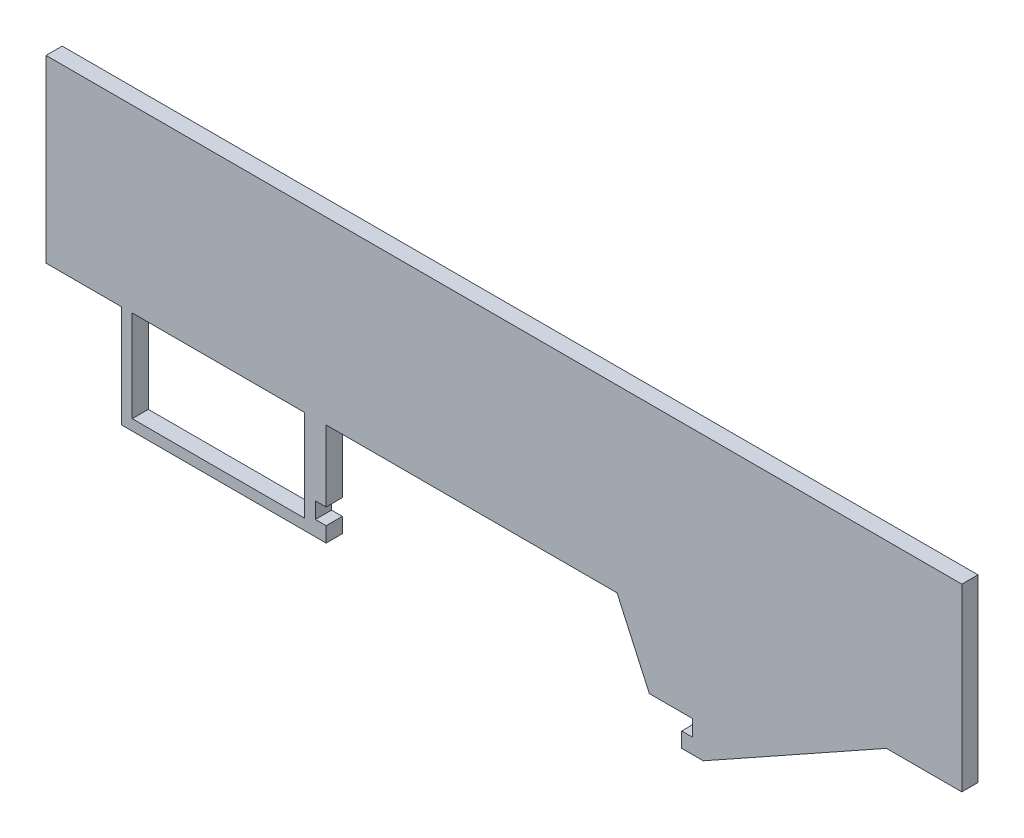
ISO-10303-21;
HEADER;
FILE_DESCRIPTION(('STEP AP214'),'2;1');
FILE_NAME('part.step','',(''),(''),'','','');
FILE_SCHEMA(('AUTOMOTIVE_DESIGN { 1 0 10303 214 1 1 1 1 }'));
ENDSEC;
DATA;
#1=APPLICATION_CONTEXT('core data for automotive mechanical design processes');
#2=APPLICATION_PROTOCOL_DEFINITION('international standard','automotive_design',2000,#1);
#3=PRODUCT_CONTEXT('',#1,'mechanical');
#4=PRODUCT('Part','Part','',(#3));
#5=PRODUCT_RELATED_PRODUCT_CATEGORY('part','',(#4));
#6=PRODUCT_DEFINITION_FORMATION('','',#4);
#7=PRODUCT_DEFINITION_CONTEXT('part definition',#1,'design');
#8=PRODUCT_DEFINITION('design','',#6,#7);
#9=PRODUCT_DEFINITION_SHAPE('','',#8);
#10=(LENGTH_UNIT() NAMED_UNIT(*) SI_UNIT(.MILLI.,.METRE.));
#11=(NAMED_UNIT(*) PLANE_ANGLE_UNIT() SI_UNIT($,.RADIAN.));
#12=(NAMED_UNIT(*) SI_UNIT($,.STERADIAN.) SOLID_ANGLE_UNIT());
#13=UNCERTAINTY_MEASURE_WITH_UNIT(LENGTH_MEASURE(1.E-05),#10,'distance_accuracy_value','');
#14=(GEOMETRIC_REPRESENTATION_CONTEXT(3) GLOBAL_UNCERTAINTY_ASSIGNED_CONTEXT((#13)) GLOBAL_UNIT_ASSIGNED_CONTEXT((#10,
#11,#12)) REPRESENTATION_CONTEXT('',''));
#15=CARTESIAN_POINT('',(0.,0.,0.));
#16=DIRECTION('',(0.,0.,1.));
#17=DIRECTION('',(1.,0.,0.));
#18=AXIS2_PLACEMENT_3D('',#15,#16,#17);
#19=CARTESIAN_POINT('',(0.,0.,1.5));
#20=DIRECTION('',(0.,0.,-1.));
#21=DIRECTION('',(-1.,0.,0.));
#22=AXIS2_PLACEMENT_3D('',#19,#20,#21);
#23=PLANE('',#22);
#24=DIRECTION('',(0.,-1.,0.));
#25=VECTOR('',#24,1.);
#26=CARTESIAN_POINT('',(-42.5,23.3,1.5));
#27=LINE('',#26,#25);
#28=CARTESIAN_POINT('',(-42.5,23.3,1.5));
#29=VERTEX_POINT('',#28);
#30=CARTESIAN_POINT('',(-42.5,6.59999999999998,1.5));
#31=VERTEX_POINT('',#30);
#32=EDGE_CURVE('E229',#29,#31,#27,.T.);
#33=ORIENTED_EDGE('',*,*,#32,.T.);
#34=DIRECTION('',(1.,0.,0.));
#35=VECTOR('',#34,1.);
#36=CARTESIAN_POINT('',(-35.5,6.59999999999999,1.5));
#37=LINE('',#36,#35);
#38=CARTESIAN_POINT('',(-35.5,6.59999999999999,1.5));
#39=VERTEX_POINT('',#38);
#40=EDGE_CURVE('E232',#31,#39,#37,.T.);
#41=ORIENTED_EDGE('',*,*,#40,.T.);
#42=DIRECTION('',(0.,-1.,0.));
#43=VECTOR('',#42,1.);
#44=CARTESIAN_POINT('',(-35.5,-2.90000000000001,1.5));
#45=LINE('',#44,#43);
#46=CARTESIAN_POINT('',(-35.5,-2.90000000000001,1.5));
#47=VERTEX_POINT('',#46);
#48=EDGE_CURVE('E235',#39,#47,#45,.T.);
#49=ORIENTED_EDGE('',*,*,#48,.T.);
#50=DIRECTION('',(1.,0.,0.));
#51=VECTOR('',#50,1.);
#52=CARTESIAN_POINT('',(-16.5,-2.90000000000001,1.5));
#53=LINE('',#52,#51);
#54=CARTESIAN_POINT('',(-16.5,-2.90000000000001,1.5));
#55=VERTEX_POINT('',#54);
#56=EDGE_CURVE('E237',#47,#55,#53,.T.);
#57=ORIENTED_EDGE('',*,*,#56,.T.);
#58=DIRECTION('',(0.,1.,0.));
#59=VECTOR('',#58,1.);
#60=CARTESIAN_POINT('',(-16.5,-1.5,1.5));
#61=LINE('',#60,#59);
#62=CARTESIAN_POINT('',(-16.5,-1.5,1.5));
#63=VERTEX_POINT('',#62);
#64=EDGE_CURVE('E239',#55,#63,#61,.T.);
#65=ORIENTED_EDGE('',*,*,#64,.T.);
#66=DIRECTION('',(-1.,0.,0.));
#67=VECTOR('',#66,1.);
#68=CARTESIAN_POINT('',(-17.5,-1.5,1.5));
#69=LINE('',#68,#67);
#70=CARTESIAN_POINT('',(-17.5,-1.5,1.5));
#71=VERTEX_POINT('',#70);
#72=EDGE_CURVE('E241',#63,#71,#69,.T.);
#73=ORIENTED_EDGE('',*,*,#72,.T.);
#74=DIRECTION('',(0.,1.,0.));
#75=VECTOR('',#74,1.);
#76=CARTESIAN_POINT('',(-17.5,0.,1.5));
#77=LINE('',#76,#75);
#78=CARTESIAN_POINT('',(-17.5,0.,1.5));
#79=VERTEX_POINT('',#78);
#80=EDGE_CURVE('E243',#71,#79,#77,.T.);
#81=ORIENTED_EDGE('',*,*,#80,.T.);
#82=DIRECTION('',(1.,0.,0.));
#83=VECTOR('',#82,1.);
#84=CARTESIAN_POINT('',(-16.5,0.,1.5));
#85=LINE('',#84,#83);
#86=CARTESIAN_POINT('',(-16.5,0.,1.5));
#87=VERTEX_POINT('',#86);
#88=EDGE_CURVE('E245',#79,#87,#85,.T.);
#89=ORIENTED_EDGE('',*,*,#88,.T.);
#90=DIRECTION('',(0.,1.,0.));
#91=VECTOR('',#90,1.);
#92=CARTESIAN_POINT('',(-16.5,6.59999999999999,1.5));
#93=LINE('',#92,#91);
#94=CARTESIAN_POINT('',(-16.5,6.59999999999999,1.5));
#95=VERTEX_POINT('',#94);
#96=EDGE_CURVE('E247',#87,#95,#93,.T.);
#97=ORIENTED_EDGE('',*,*,#96,.T.);
#98=DIRECTION('',(1.,0.,0.));
#99=VECTOR('',#98,1.);
#100=CARTESIAN_POINT('',(10.5,6.59999999999999,1.5));
#101=LINE('',#100,#99);
#102=CARTESIAN_POINT('',(10.5,6.59999999999999,1.5));
#103=VERTEX_POINT('',#102);
#104=EDGE_CURVE('E249',#95,#103,#101,.T.);
#105=ORIENTED_EDGE('',*,*,#104,.T.);
#106=DIRECTION('',(0.413802944301184,-0.910366477462605,0.));
#107=VECTOR('',#106,1.);
#108=CARTESIAN_POINT('',(13.5,0.,1.5));
#109=LINE('',#108,#107);
#110=CARTESIAN_POINT('',(13.5,0.,1.5));
#111=VERTEX_POINT('',#110);
#112=EDGE_CURVE('E251',#103,#111,#109,.T.);
#113=ORIENTED_EDGE('',*,*,#112,.T.);
#114=DIRECTION('',(1.,0.,0.));
#115=VECTOR('',#114,1.);
#116=CARTESIAN_POINT('',(17.5,0.,1.5));
#117=LINE('',#116,#115);
#118=CARTESIAN_POINT('',(17.5,0.,1.5));
#119=VERTEX_POINT('',#118);
#120=EDGE_CURVE('E253',#111,#119,#117,.T.);
#121=ORIENTED_EDGE('',*,*,#120,.T.);
#122=DIRECTION('',(0.,-1.,0.));
#123=VECTOR('',#122,1.);
#124=CARTESIAN_POINT('',(17.5,-1.5,1.5));
#125=LINE('',#124,#123);
#126=CARTESIAN_POINT('',(17.5,-1.5,1.5));
#127=VERTEX_POINT('',#126);
#128=EDGE_CURVE('E255',#119,#127,#125,.T.);
#129=ORIENTED_EDGE('',*,*,#128,.T.);
#130=DIRECTION('',(-1.,0.,0.));
#131=VECTOR('',#130,1.);
#132=CARTESIAN_POINT('',(16.5,-1.5,1.5));
#133=LINE('',#132,#131);
#134=CARTESIAN_POINT('',(16.5,-1.5,1.5));
#135=VERTEX_POINT('',#134);
#136=EDGE_CURVE('E257',#127,#135,#133,.T.);
#137=ORIENTED_EDGE('',*,*,#136,.T.);
#138=DIRECTION('',(0.,-1.,0.));
#139=VECTOR('',#138,1.);
#140=CARTESIAN_POINT('',(16.5,-2.9,1.5));
#141=LINE('',#140,#139);
#142=CARTESIAN_POINT('',(16.5,-2.9,1.5));
#143=VERTEX_POINT('',#142);
#144=EDGE_CURVE('E259',#135,#143,#141,.T.);
#145=ORIENTED_EDGE('',*,*,#144,.T.);
#146=DIRECTION('',(1.,0.,0.));
#147=VECTOR('',#146,1.);
#148=CARTESIAN_POINT('',(18.5,-2.90000000000001,1.5));
#149=LINE('',#148,#147);
#150=CARTESIAN_POINT('',(18.5,-2.90000000000001,1.5));
#151=VERTEX_POINT('',#150);
#152=EDGE_CURVE('E261',#143,#151,#149,.T.);
#153=ORIENTED_EDGE('',*,*,#152,.T.);
#154=DIRECTION('',(0.872943482137264,0.487821357664942,0.));
#155=VECTOR('',#154,1.);
#156=CARTESIAN_POINT('',(35.5,6.59999999999999,1.5));
#157=LINE('',#156,#155);
#158=CARTESIAN_POINT('',(35.5,6.59999999999999,1.5));
#159=VERTEX_POINT('',#158);
#160=EDGE_CURVE('E263',#151,#159,#157,.T.);
#161=ORIENTED_EDGE('',*,*,#160,.T.);
#162=DIRECTION('',(1.,0.,0.));
#163=VECTOR('',#162,1.);
#164=CARTESIAN_POINT('',(42.5,6.59999999999999,1.5));
#165=LINE('',#164,#163);
#166=CARTESIAN_POINT('',(42.5,6.59999999999999,1.5));
#167=VERTEX_POINT('',#166);
#168=EDGE_CURVE('E265',#159,#167,#165,.T.);
#169=ORIENTED_EDGE('',*,*,#168,.T.);
#170=DIRECTION('',(0.,1.,0.));
#171=VECTOR('',#170,1.);
#172=CARTESIAN_POINT('',(42.5,23.3,1.5));
#173=LINE('',#172,#171);
#174=CARTESIAN_POINT('',(42.5,23.3,1.5));
#175=VERTEX_POINT('',#174);
#176=EDGE_CURVE('E267',#167,#175,#173,.T.);
#177=ORIENTED_EDGE('',*,*,#176,.T.);
#178=DIRECTION('',(-1.,0.,0.));
#179=VECTOR('',#178,1.);
#180=CARTESIAN_POINT('',(-42.5,23.3,1.5));
#181=LINE('',#180,#179);
#182=EDGE_CURVE('E269',#175,#29,#181,.T.);
#183=ORIENTED_EDGE('',*,*,#182,.T.);
#184=EDGE_LOOP('',(#33,#41,#49,#57,#65,#73,#81,#89,#97,#105,#113,#121,#129,#137,#145,#153,#161,
#169,#177,#183));
#185=FACE_BOUND('',#184,.T.);
#186=DIRECTION('',(-1.,0.,0.));
#187=VECTOR('',#186,1.);
#188=CARTESIAN_POINT('',(-18.5,6.6,1.5));
#189=LINE('',#188,#187);
#190=CARTESIAN_POINT('',(-18.5,6.6,1.5));
#191=VERTEX_POINT('',#190);
#192=CARTESIAN_POINT('',(-34.5,6.59999999999999,1.5));
#193=VERTEX_POINT('',#192);
#194=EDGE_CURVE('E193',#191,#193,#189,.T.);
#195=ORIENTED_EDGE('',*,*,#194,.F.);
#196=DIRECTION('',(0.,1.,0.));
#197=VECTOR('',#196,1.);
#198=CARTESIAN_POINT('',(-18.5,-1.90000000000001,1.5));
#199=LINE('',#198,#197);
#200=CARTESIAN_POINT('',(-18.5,-1.90000000000001,1.5));
#201=VERTEX_POINT('',#200);
#202=EDGE_CURVE('E215',#201,#191,#199,.T.);
#203=ORIENTED_EDGE('',*,*,#202,.F.);
#204=DIRECTION('',(1.,0.,0.));
#205=VECTOR('',#204,1.);
#206=CARTESIAN_POINT('',(-34.5,-1.90000000000001,1.5));
#207=LINE('',#206,#205);
#208=CARTESIAN_POINT('',(-34.5,-1.90000000000001,1.5));
#209=VERTEX_POINT('',#208);
#210=EDGE_CURVE('E213',#209,#201,#207,.T.);
#211=ORIENTED_EDGE('',*,*,#210,.F.);
#212=DIRECTION('',(0.,-1.,0.));
#213=VECTOR('',#212,1.);
#214=CARTESIAN_POINT('',(-34.5,6.59999999999999,1.5));
#215=LINE('',#214,#213);
#216=EDGE_CURVE('E201',#193,#209,#215,.T.);
#217=ORIENTED_EDGE('',*,*,#216,.F.);
#218=EDGE_LOOP('',(#195,#203,#211,#217));
#219=FACE_BOUND('',#218,.T.);
#220=ADVANCED_FACE('F32',(#185,#219),#23,.F.);
#221=CARTESIAN_POINT('',(0.,0.,0.));
#222=DIRECTION('',(0.,0.,-1.));
#223=DIRECTION('',(-1.,0.,0.));
#224=AXIS2_PLACEMENT_3D('',#221,#222,#223);
#225=PLANE('',#224);
#226=DIRECTION('',(0.,-1.,0.));
#227=VECTOR('',#226,1.);
#228=CARTESIAN_POINT('',(-42.5,23.3,0.));
#229=LINE('',#228,#227);
#230=CARTESIAN_POINT('',(-42.5,23.3,0.));
#231=VERTEX_POINT('',#230);
#232=CARTESIAN_POINT('',(-42.5,6.59999999999998,0.));
#233=VERTEX_POINT('',#232);
#234=EDGE_CURVE('E209',#231,#233,#229,.T.);
#235=ORIENTED_EDGE('',*,*,#234,.F.);
#236=DIRECTION('',(-1.,0.,0.));
#237=VECTOR('',#236,1.);
#238=CARTESIAN_POINT('',(-42.5,23.3,0.));
#239=LINE('',#238,#237);
#240=CARTESIAN_POINT('',(42.5,23.3,0.));
#241=VERTEX_POINT('',#240);
#242=EDGE_CURVE('E233',#241,#231,#239,.T.);
#243=ORIENTED_EDGE('',*,*,#242,.F.);
#244=DIRECTION('',(0.,1.,0.));
#245=VECTOR('',#244,1.);
#246=CARTESIAN_POINT('',(42.5,23.3,0.));
#247=LINE('',#246,#245);
#248=CARTESIAN_POINT('',(42.5,6.59999999999999,0.));
#249=VERTEX_POINT('',#248);
#250=EDGE_CURVE('E308',#249,#241,#247,.T.);
#251=ORIENTED_EDGE('',*,*,#250,.F.);
#252=DIRECTION('',(1.,0.,0.));
#253=VECTOR('',#252,1.);
#254=CARTESIAN_POINT('',(42.5,6.59999999999999,0.));
#255=LINE('',#254,#253);
#256=CARTESIAN_POINT('',(35.5,6.59999999999999,0.));
#257=VERTEX_POINT('',#256);
#258=EDGE_CURVE('E306',#257,#249,#255,.T.);
#259=ORIENTED_EDGE('',*,*,#258,.F.);
#260=DIRECTION('',(0.872943482137264,0.487821357664942,0.));
#261=VECTOR('',#260,1.);
#262=CARTESIAN_POINT('',(35.5,6.59999999999999,0.));
#263=LINE('',#262,#261);
#264=CARTESIAN_POINT('',(18.5,-2.90000000000001,0.));
#265=VERTEX_POINT('',#264);
#266=EDGE_CURVE('E304',#265,#257,#263,.T.);
#267=ORIENTED_EDGE('',*,*,#266,.F.);
#268=DIRECTION('',(1.,0.,0.));
#269=VECTOR('',#268,1.);
#270=CARTESIAN_POINT('',(18.5,-2.90000000000001,0.));
#271=LINE('',#270,#269);
#272=CARTESIAN_POINT('',(16.5,-2.9,0.));
#273=VERTEX_POINT('',#272);
#274=EDGE_CURVE('E302',#273,#265,#271,.T.);
#275=ORIENTED_EDGE('',*,*,#274,.F.);
#276=DIRECTION('',(0.,-1.,0.));
#277=VECTOR('',#276,1.);
#278=CARTESIAN_POINT('',(16.5,-2.9,0.));
#279=LINE('',#278,#277);
#280=CARTESIAN_POINT('',(16.5,-1.5,0.));
#281=VERTEX_POINT('',#280);
#282=EDGE_CURVE('E300',#281,#273,#279,.T.);
#283=ORIENTED_EDGE('',*,*,#282,.F.);
#284=DIRECTION('',(-1.,0.,0.));
#285=VECTOR('',#284,1.);
#286=CARTESIAN_POINT('',(16.5,-1.5,0.));
#287=LINE('',#286,#285);
#288=CARTESIAN_POINT('',(17.5,-1.5,0.));
#289=VERTEX_POINT('',#288);
#290=EDGE_CURVE('E298',#289,#281,#287,.T.);
#291=ORIENTED_EDGE('',*,*,#290,.F.);
#292=DIRECTION('',(0.,-1.,0.));
#293=VECTOR('',#292,1.);
#294=CARTESIAN_POINT('',(17.5,-1.5,0.));
#295=LINE('',#294,#293);
#296=CARTESIAN_POINT('',(17.5,0.,0.));
#297=VERTEX_POINT('',#296);
#298=EDGE_CURVE('E296',#297,#289,#295,.T.);
#299=ORIENTED_EDGE('',*,*,#298,.F.);
#300=DIRECTION('',(1.,0.,0.));
#301=VECTOR('',#300,1.);
#302=CARTESIAN_POINT('',(17.5,0.,0.));
#303=LINE('',#302,#301);
#304=CARTESIAN_POINT('',(13.5,0.,0.));
#305=VERTEX_POINT('',#304);
#306=EDGE_CURVE('E294',#305,#297,#303,.T.);
#307=ORIENTED_EDGE('',*,*,#306,.F.);
#308=DIRECTION('',(0.413802944301184,-0.910366477462605,0.));
#309=VECTOR('',#308,1.);
#310=CARTESIAN_POINT('',(13.5,0.,0.));
#311=LINE('',#310,#309);
#312=CARTESIAN_POINT('',(10.5,6.59999999999999,0.));
#313=VERTEX_POINT('',#312);
#314=EDGE_CURVE('E292',#313,#305,#311,.T.);
#315=ORIENTED_EDGE('',*,*,#314,.F.);
#316=DIRECTION('',(1.,0.,0.));
#317=VECTOR('',#316,1.);
#318=CARTESIAN_POINT('',(10.5,6.59999999999999,0.));
#319=LINE('',#318,#317);
#320=CARTESIAN_POINT('',(-16.5,6.59999999999999,0.));
#321=VERTEX_POINT('',#320);
#322=EDGE_CURVE('E290',#321,#313,#319,.T.);
#323=ORIENTED_EDGE('',*,*,#322,.F.);
#324=DIRECTION('',(0.,1.,0.));
#325=VECTOR('',#324,1.);
#326=CARTESIAN_POINT('',(-16.5,6.59999999999999,0.));
#327=LINE('',#326,#325);
#328=CARTESIAN_POINT('',(-16.5,0.,0.));
#329=VERTEX_POINT('',#328);
#330=EDGE_CURVE('E288',#329,#321,#327,.T.);
#331=ORIENTED_EDGE('',*,*,#330,.F.);
#332=DIRECTION('',(1.,0.,0.));
#333=VECTOR('',#332,1.);
#334=CARTESIAN_POINT('',(-16.5,0.,0.));
#335=LINE('',#334,#333);
#336=CARTESIAN_POINT('',(-17.5,0.,0.));
#337=VERTEX_POINT('',#336);
#338=EDGE_CURVE('E286',#337,#329,#335,.T.);
#339=ORIENTED_EDGE('',*,*,#338,.F.);
#340=DIRECTION('',(0.,1.,0.));
#341=VECTOR('',#340,1.);
#342=CARTESIAN_POINT('',(-17.5,0.,0.));
#343=LINE('',#342,#341);
#344=CARTESIAN_POINT('',(-17.5,-1.5,0.));
#345=VERTEX_POINT('',#344);
#346=EDGE_CURVE('E284',#345,#337,#343,.T.);
#347=ORIENTED_EDGE('',*,*,#346,.F.);
#348=DIRECTION('',(-1.,0.,0.));
#349=VECTOR('',#348,1.);
#350=CARTESIAN_POINT('',(-17.5,-1.5,0.));
#351=LINE('',#350,#349);
#352=CARTESIAN_POINT('',(-16.5,-1.5,0.));
#353=VERTEX_POINT('',#352);
#354=EDGE_CURVE('E282',#353,#345,#351,.T.);
#355=ORIENTED_EDGE('',*,*,#354,.F.);
#356=DIRECTION('',(0.,1.,0.));
#357=VECTOR('',#356,1.);
#358=CARTESIAN_POINT('',(-16.5,-1.5,0.));
#359=LINE('',#358,#357);
#360=CARTESIAN_POINT('',(-16.5,-2.90000000000001,0.));
#361=VERTEX_POINT('',#360);
#362=EDGE_CURVE('E280',#361,#353,#359,.T.);
#363=ORIENTED_EDGE('',*,*,#362,.F.);
#364=DIRECTION('',(1.,0.,0.));
#365=VECTOR('',#364,1.);
#366=CARTESIAN_POINT('',(-16.5,-2.90000000000001,0.));
#367=LINE('',#366,#365);
#368=CARTESIAN_POINT('',(-35.5,-2.90000000000001,0.));
#369=VERTEX_POINT('',#368);
#370=EDGE_CURVE('E278',#369,#361,#367,.T.);
#371=ORIENTED_EDGE('',*,*,#370,.F.);
#372=DIRECTION('',(0.,-1.,0.));
#373=VECTOR('',#372,1.);
#374=CARTESIAN_POINT('',(-35.5,-2.90000000000001,0.));
#375=LINE('',#374,#373);
#376=CARTESIAN_POINT('',(-35.5,6.59999999999999,0.));
#377=VERTEX_POINT('',#376);
#378=EDGE_CURVE('E276',#377,#369,#375,.T.);
#379=ORIENTED_EDGE('',*,*,#378,.F.);
#380=DIRECTION('',(1.,0.,0.));
#381=VECTOR('',#380,1.);
#382=CARTESIAN_POINT('',(-35.5,6.59999999999999,0.));
#383=LINE('',#382,#381);
#384=EDGE_CURVE('E274',#233,#377,#383,.T.);
#385=ORIENTED_EDGE('',*,*,#384,.F.);
#386=EDGE_LOOP('',(#235,#243,#251,#259,#267,#275,#283,#291,#299,#307,#315,#323,#331,#339,#347,
#355,#363,#371,#379,#385));
#387=FACE_BOUND('',#386,.T.);
#388=DIRECTION('',(0.,1.,0.));
#389=VECTOR('',#388,1.);
#390=CARTESIAN_POINT('',(-18.5,-1.90000000000001,0.));
#391=LINE('',#390,#389);
#392=CARTESIAN_POINT('',(-18.5,-1.90000000000001,0.));
#393=VERTEX_POINT('',#392);
#394=CARTESIAN_POINT('',(-18.5,6.6,0.));
#395=VERTEX_POINT('',#394);
#396=EDGE_CURVE('E202',#393,#395,#391,.T.);
#397=ORIENTED_EDGE('',*,*,#396,.T.);
#398=DIRECTION('',(-1.,0.,0.));
#399=VECTOR('',#398,1.);
#400=CARTESIAN_POINT('',(-18.5,6.6,0.));
#401=LINE('',#400,#399);
#402=CARTESIAN_POINT('',(-34.5,6.59999999999999,0.));
#403=VERTEX_POINT('',#402);
#404=EDGE_CURVE('E55',#395,#403,#401,.T.);
#405=ORIENTED_EDGE('',*,*,#404,.T.);
#406=DIRECTION('',(0.,-1.,0.));
#407=VECTOR('',#406,1.);
#408=CARTESIAN_POINT('',(-34.5,6.59999999999999,0.));
#409=LINE('',#408,#407);
#410=CARTESIAN_POINT('',(-34.5,-1.90000000000001,0.));
#411=VERTEX_POINT('',#410);
#412=EDGE_CURVE('E208',#403,#411,#409,.T.);
#413=ORIENTED_EDGE('',*,*,#412,.T.);
#414=DIRECTION('',(1.,0.,0.));
#415=VECTOR('',#414,1.);
#416=CARTESIAN_POINT('',(-34.5,-1.90000000000001,0.));
#417=LINE('',#416,#415);
#418=EDGE_CURVE('E221',#411,#393,#417,.T.);
#419=ORIENTED_EDGE('',*,*,#418,.T.);
#420=EDGE_LOOP('',(#397,#405,#413,#419));
#421=FACE_BOUND('',#420,.T.);
#422=ADVANCED_FACE('F374',(#387,#421),#225,.T.);
#423=CARTESIAN_POINT('',(-42.5,23.3,1.5));
#424=DIRECTION('',(1.,0.,0.));
#425=DIRECTION('',(0.,0.,-1.));
#426=AXIS2_PLACEMENT_3D('',#423,#424,#425);
#427=PLANE('',#426);
#428=ORIENTED_EDGE('',*,*,#234,.T.);
#429=DIRECTION('',(0.,0.,-1.));
#430=VECTOR('',#429,1.);
#431=CARTESIAN_POINT('',(-42.5,6.59999999999998,1.5));
#432=LINE('',#431,#430);
#433=EDGE_CURVE('E11',#31,#233,#432,.T.);
#434=ORIENTED_EDGE('',*,*,#433,.F.);
#435=ORIENTED_EDGE('',*,*,#32,.F.);
#436=DIRECTION('',(0.,0.,-1.));
#437=VECTOR('',#436,1.);
#438=CARTESIAN_POINT('',(-42.5,23.3,1.5));
#439=LINE('',#438,#437);
#440=EDGE_CURVE('E271',#29,#231,#439,.T.);
#441=ORIENTED_EDGE('',*,*,#440,.T.);
#442=EDGE_LOOP('',(#428,#434,#435,#441));
#443=FACE_BOUND('',#442,.T.);
#444=ADVANCED_FACE('F34',(#443),#427,.F.);
#445=CARTESIAN_POINT('',(-35.5,6.59999999999999,1.5));
#446=DIRECTION('',(0.,1.,0.));
#447=DIRECTION('',(-1.,0.,0.));
#448=AXIS2_PLACEMENT_3D('',#445,#446,#447);
#449=PLANE('',#448);
#450=ORIENTED_EDGE('',*,*,#384,.T.);
#451=DIRECTION('',(0.,0.,-1.));
#452=VECTOR('',#451,1.);
#453=CARTESIAN_POINT('',(-35.5,6.59999999999999,1.5));
#454=LINE('',#453,#452);
#455=EDGE_CURVE('E40',#39,#377,#454,.T.);
#456=ORIENTED_EDGE('',*,*,#455,.F.);
#457=ORIENTED_EDGE('',*,*,#40,.F.);
#458=ORIENTED_EDGE('',*,*,#433,.T.);
#459=EDGE_LOOP('',(#450,#456,#457,#458));
#460=FACE_BOUND('',#459,.T.);
#461=ADVANCED_FACE('F391',(#460),#449,.F.);
#462=CARTESIAN_POINT('',(-35.5,-2.90000000000001,1.5));
#463=DIRECTION('',(1.,0.,0.));
#464=DIRECTION('',(0.,0.,-1.));
#465=AXIS2_PLACEMENT_3D('',#462,#463,#464);
#466=PLANE('',#465);
#467=ORIENTED_EDGE('',*,*,#378,.T.);
#468=DIRECTION('',(0.,0.,-1.));
#469=VECTOR('',#468,1.);
#470=CARTESIAN_POINT('',(-35.5,-2.90000000000001,1.5));
#471=LINE('',#470,#469);
#472=EDGE_CURVE('E361',#47,#369,#471,.T.);
#473=ORIENTED_EDGE('',*,*,#472,.F.);
#474=ORIENTED_EDGE('',*,*,#48,.F.);
#475=ORIENTED_EDGE('',*,*,#455,.T.);
#476=EDGE_LOOP('',(#467,#473,#474,#475));
#477=FACE_BOUND('',#476,.T.);
#478=ADVANCED_FACE('F368',(#477),#466,.F.);
#479=CARTESIAN_POINT('',(-16.5,-2.90000000000001,1.5));
#480=DIRECTION('',(0.,1.,0.));
#481=DIRECTION('',(-1.,0.,0.));
#482=AXIS2_PLACEMENT_3D('',#479,#480,#481);
#483=PLANE('',#482);
#484=ORIENTED_EDGE('',*,*,#370,.T.);
#485=DIRECTION('',(0.,0.,-1.));
#486=VECTOR('',#485,1.);
#487=CARTESIAN_POINT('',(-16.5,-2.90000000000001,1.5));
#488=LINE('',#487,#486);
#489=EDGE_CURVE('E358',#55,#361,#488,.T.);
#490=ORIENTED_EDGE('',*,*,#489,.F.);
#491=ORIENTED_EDGE('',*,*,#56,.F.);
#492=ORIENTED_EDGE('',*,*,#472,.T.);
#493=EDGE_LOOP('',(#484,#490,#491,#492));
#494=FACE_BOUND('',#493,.T.);
#495=ADVANCED_FACE('F380',(#494),#483,.F.);
#496=CARTESIAN_POINT('',(-16.5,-1.5,1.5));
#497=DIRECTION('',(-1.,0.,0.));
#498=DIRECTION('',(0.,0.,1.));
#499=AXIS2_PLACEMENT_3D('',#496,#497,#498);
#500=PLANE('',#499);
#501=ORIENTED_EDGE('',*,*,#362,.T.);
#502=DIRECTION('',(0.,0.,-1.));
#503=VECTOR('',#502,1.);
#504=CARTESIAN_POINT('',(-16.5,-1.5,1.5));
#505=LINE('',#504,#503);
#506=EDGE_CURVE('E355',#63,#353,#505,.T.);
#507=ORIENTED_EDGE('',*,*,#506,.F.);
#508=ORIENTED_EDGE('',*,*,#64,.F.);
#509=ORIENTED_EDGE('',*,*,#489,.T.);
#510=EDGE_LOOP('',(#501,#507,#508,#509));
#511=FACE_BOUND('',#510,.T.);
#512=ADVANCED_FACE('F384',(#511),#500,.F.);
#513=CARTESIAN_POINT('',(-17.5,-1.5,1.5));
#514=DIRECTION('',(0.,-1.,0.));
#515=DIRECTION('',(0.,0.,-1.));
#516=AXIS2_PLACEMENT_3D('',#513,#514,#515);
#517=PLANE('',#516);
#518=ORIENTED_EDGE('',*,*,#354,.T.);
#519=DIRECTION('',(0.,0.,-1.));
#520=VECTOR('',#519,1.);
#521=CARTESIAN_POINT('',(-17.5,-1.5,1.5));
#522=LINE('',#521,#520);
#523=EDGE_CURVE('E352',#71,#345,#522,.T.);
#524=ORIENTED_EDGE('',*,*,#523,.F.);
#525=ORIENTED_EDGE('',*,*,#72,.F.);
#526=ORIENTED_EDGE('',*,*,#506,.T.);
#527=EDGE_LOOP('',(#518,#524,#525,#526));
#528=FACE_BOUND('',#527,.T.);
#529=ADVANCED_FACE('F464',(#528),#517,.F.);
#530=CARTESIAN_POINT('',(-17.5,0.,1.5));
#531=DIRECTION('',(-1.,0.,0.));
#532=DIRECTION('',(0.,0.,1.));
#533=AXIS2_PLACEMENT_3D('',#530,#531,#532);
#534=PLANE('',#533);
#535=ORIENTED_EDGE('',*,*,#346,.T.);
#536=DIRECTION('',(0.,0.,-1.));
#537=VECTOR('',#536,1.);
#538=CARTESIAN_POINT('',(-17.5,0.,1.5));
#539=LINE('',#538,#537);
#540=EDGE_CURVE('E349',#79,#337,#539,.T.);
#541=ORIENTED_EDGE('',*,*,#540,.F.);
#542=ORIENTED_EDGE('',*,*,#80,.F.);
#543=ORIENTED_EDGE('',*,*,#523,.T.);
#544=EDGE_LOOP('',(#535,#541,#542,#543));
#545=FACE_BOUND('',#544,.T.);
#546=ADVANCED_FACE('F462',(#545),#534,.F.);
#547=CARTESIAN_POINT('',(-16.5,0.,1.5));
#548=DIRECTION('',(0.,1.,0.));
#549=DIRECTION('',(0.,0.,1.));
#550=AXIS2_PLACEMENT_3D('',#547,#548,#549);
#551=PLANE('',#550);
#552=ORIENTED_EDGE('',*,*,#338,.T.);
#553=DIRECTION('',(0.,0.,-1.));
#554=VECTOR('',#553,1.);
#555=CARTESIAN_POINT('',(-16.5,0.,1.5));
#556=LINE('',#555,#554);
#557=EDGE_CURVE('E346',#87,#329,#556,.T.);
#558=ORIENTED_EDGE('',*,*,#557,.F.);
#559=ORIENTED_EDGE('',*,*,#88,.F.);
#560=ORIENTED_EDGE('',*,*,#540,.T.);
#561=EDGE_LOOP('',(#552,#558,#559,#560));
#562=FACE_BOUND('',#561,.T.);
#563=ADVANCED_FACE('F457',(#562),#551,.F.);
#564=CARTESIAN_POINT('',(-16.5,6.59999999999999,1.5));
#565=DIRECTION('',(-1.,0.,0.));
#566=DIRECTION('',(0.,0.,1.));
#567=AXIS2_PLACEMENT_3D('',#564,#565,#566);
#568=PLANE('',#567);
#569=ORIENTED_EDGE('',*,*,#330,.T.);
#570=DIRECTION('',(0.,0.,-1.));
#571=VECTOR('',#570,1.);
#572=CARTESIAN_POINT('',(-16.5,6.59999999999999,1.5));
#573=LINE('',#572,#571);
#574=EDGE_CURVE('E343',#95,#321,#573,.T.);
#575=ORIENTED_EDGE('',*,*,#574,.F.);
#576=ORIENTED_EDGE('',*,*,#96,.F.);
#577=ORIENTED_EDGE('',*,*,#557,.T.);
#578=EDGE_LOOP('',(#569,#575,#576,#577));
#579=FACE_BOUND('',#578,.T.);
#580=ADVANCED_FACE('F452',(#579),#568,.F.);
#581=CARTESIAN_POINT('',(10.5,6.59999999999999,1.5));
#582=DIRECTION('',(0.,1.,0.));
#583=DIRECTION('',(0.,0.,1.));
#584=AXIS2_PLACEMENT_3D('',#581,#582,#583);
#585=PLANE('',#584);
#586=ORIENTED_EDGE('',*,*,#322,.T.);
#587=DIRECTION('',(0.,0.,-1.));
#588=VECTOR('',#587,1.);
#589=CARTESIAN_POINT('',(10.5,6.59999999999999,1.5));
#590=LINE('',#589,#588);
#591=EDGE_CURVE('E340',#103,#313,#590,.T.);
#592=ORIENTED_EDGE('',*,*,#591,.F.);
#593=ORIENTED_EDGE('',*,*,#104,.F.);
#594=ORIENTED_EDGE('',*,*,#574,.T.);
#595=EDGE_LOOP('',(#586,#592,#593,#594));
#596=FACE_BOUND('',#595,.T.);
#597=ADVANCED_FACE('F448',(#596),#585,.F.);
#598=CARTESIAN_POINT('',(13.5,0.,1.5));
#599=DIRECTION('',(0.910366477462605,0.413802944301184,0.));
#600=DIRECTION('',(-0.413802944301184,0.910366477462605,0.));
#601=AXIS2_PLACEMENT_3D('',#598,#599,#600);
#602=PLANE('',#601);
#603=ORIENTED_EDGE('',*,*,#314,.T.);
#604=DIRECTION('',(0.,0.,-1.));
#605=VECTOR('',#604,1.);
#606=CARTESIAN_POINT('',(13.5,0.,1.5));
#607=LINE('',#606,#605);
#608=EDGE_CURVE('E337',#111,#305,#607,.T.);
#609=ORIENTED_EDGE('',*,*,#608,.F.);
#610=ORIENTED_EDGE('',*,*,#112,.F.);
#611=ORIENTED_EDGE('',*,*,#591,.T.);
#612=EDGE_LOOP('',(#603,#609,#610,#611));
#613=FACE_BOUND('',#612,.T.);
#614=ADVANCED_FACE('F443',(#613),#602,.F.);
#615=CARTESIAN_POINT('',(17.5,0.,1.5));
#616=DIRECTION('',(0.,1.,0.));
#617=DIRECTION('',(0.,0.,1.));
#618=AXIS2_PLACEMENT_3D('',#615,#616,#617);
#619=PLANE('',#618);
#620=ORIENTED_EDGE('',*,*,#306,.T.);
#621=DIRECTION('',(0.,0.,-1.));
#622=VECTOR('',#621,1.);
#623=CARTESIAN_POINT('',(17.5,0.,1.5));
#624=LINE('',#623,#622);
#625=EDGE_CURVE('E334',#119,#297,#624,.T.);
#626=ORIENTED_EDGE('',*,*,#625,.F.);
#627=ORIENTED_EDGE('',*,*,#120,.F.);
#628=ORIENTED_EDGE('',*,*,#608,.T.);
#629=EDGE_LOOP('',(#620,#626,#627,#628));
#630=FACE_BOUND('',#629,.T.);
#631=ADVANCED_FACE('F437',(#630),#619,.F.);
#632=CARTESIAN_POINT('',(17.5,-1.5,1.5));
#633=DIRECTION('',(1.,0.,0.));
#634=DIRECTION('',(0.,0.,-1.));
#635=AXIS2_PLACEMENT_3D('',#632,#633,#634);
#636=PLANE('',#635);
#637=ORIENTED_EDGE('',*,*,#298,.T.);
#638=DIRECTION('',(0.,0.,-1.));
#639=VECTOR('',#638,1.);
#640=CARTESIAN_POINT('',(17.5,-1.5,1.5));
#641=LINE('',#640,#639);
#642=EDGE_CURVE('E331',#127,#289,#641,.T.);
#643=ORIENTED_EDGE('',*,*,#642,.F.);
#644=ORIENTED_EDGE('',*,*,#128,.F.);
#645=ORIENTED_EDGE('',*,*,#625,.T.);
#646=EDGE_LOOP('',(#637,#643,#644,#645));
#647=FACE_BOUND('',#646,.T.);
#648=ADVANCED_FACE('F433',(#647),#636,.F.);
#649=CARTESIAN_POINT('',(16.5,-1.5,1.5));
#650=DIRECTION('',(0.,-1.,0.));
#651=DIRECTION('',(1.,0.,0.));
#652=AXIS2_PLACEMENT_3D('',#649,#650,#651);
#653=PLANE('',#652);
#654=ORIENTED_EDGE('',*,*,#290,.T.);
#655=DIRECTION('',(0.,0.,-1.));
#656=VECTOR('',#655,1.);
#657=CARTESIAN_POINT('',(16.5,-1.5,1.5));
#658=LINE('',#657,#656);
#659=EDGE_CURVE('E328',#135,#281,#658,.T.);
#660=ORIENTED_EDGE('',*,*,#659,.F.);
#661=ORIENTED_EDGE('',*,*,#136,.F.);
#662=ORIENTED_EDGE('',*,*,#642,.T.);
#663=EDGE_LOOP('',(#654,#660,#661,#662));
#664=FACE_BOUND('',#663,.T.);
#665=ADVANCED_FACE('F428',(#664),#653,.F.);
#666=CARTESIAN_POINT('',(16.5,-2.9,1.5));
#667=DIRECTION('',(1.,0.,0.));
#668=DIRECTION('',(0.,0.,-1.));
#669=AXIS2_PLACEMENT_3D('',#666,#667,#668);
#670=PLANE('',#669);
#671=ORIENTED_EDGE('',*,*,#282,.T.);
#672=DIRECTION('',(0.,0.,-1.));
#673=VECTOR('',#672,1.);
#674=CARTESIAN_POINT('',(16.5,-2.9,1.5));
#675=LINE('',#674,#673);
#676=EDGE_CURVE('E325',#143,#273,#675,.T.);
#677=ORIENTED_EDGE('',*,*,#676,.F.);
#678=ORIENTED_EDGE('',*,*,#144,.F.);
#679=ORIENTED_EDGE('',*,*,#659,.T.);
#680=EDGE_LOOP('',(#671,#677,#678,#679));
#681=FACE_BOUND('',#680,.T.);
#682=ADVANCED_FACE('F422',(#681),#670,.F.);
#683=CARTESIAN_POINT('',(18.5,-2.90000000000001,1.5));
#684=DIRECTION('',(0.,1.,0.));
#685=DIRECTION('',(-1.,0.,0.));
#686=AXIS2_PLACEMENT_3D('',#683,#684,#685);
#687=PLANE('',#686);
#688=ORIENTED_EDGE('',*,*,#274,.T.);
#689=DIRECTION('',(0.,0.,-1.));
#690=VECTOR('',#689,1.);
#691=CARTESIAN_POINT('',(18.5,-2.90000000000001,1.5));
#692=LINE('',#691,#690);
#693=EDGE_CURVE('E322',#151,#265,#692,.T.);
#694=ORIENTED_EDGE('',*,*,#693,.F.);
#695=ORIENTED_EDGE('',*,*,#152,.F.);
#696=ORIENTED_EDGE('',*,*,#676,.T.);
#697=EDGE_LOOP('',(#688,#694,#695,#696));
#698=FACE_BOUND('',#697,.T.);
#699=ADVANCED_FACE('F418',(#698),#687,.F.);
#700=CARTESIAN_POINT('',(35.5,6.59999999999999,1.5));
#701=DIRECTION('',(-0.487821357664942,0.872943482137265,0.));
#702=DIRECTION('',(-0.872943482137265,-0.487821357664942,0.));
#703=AXIS2_PLACEMENT_3D('',#700,#701,#702);
#704=PLANE('',#703);
#705=ORIENTED_EDGE('',*,*,#266,.T.);
#706=DIRECTION('',(0.,0.,-1.));
#707=VECTOR('',#706,1.);
#708=CARTESIAN_POINT('',(35.5,6.59999999999999,1.5));
#709=LINE('',#708,#707);
#710=EDGE_CURVE('E319',#159,#257,#709,.T.);
#711=ORIENTED_EDGE('',*,*,#710,.F.);
#712=ORIENTED_EDGE('',*,*,#160,.F.);
#713=ORIENTED_EDGE('',*,*,#693,.T.);
#714=EDGE_LOOP('',(#705,#711,#712,#713));
#715=FACE_BOUND('',#714,.T.);
#716=ADVANCED_FACE('F413',(#715),#704,.F.);
#717=CARTESIAN_POINT('',(42.5,6.59999999999999,1.5));
#718=DIRECTION('',(0.,1.,0.));
#719=DIRECTION('',(0.,0.,1.));
#720=AXIS2_PLACEMENT_3D('',#717,#718,#719);
#721=PLANE('',#720);
#722=ORIENTED_EDGE('',*,*,#258,.T.);
#723=DIRECTION('',(0.,0.,-1.));
#724=VECTOR('',#723,1.);
#725=CARTESIAN_POINT('',(42.5,6.59999999999999,1.5));
#726=LINE('',#725,#724);
#727=EDGE_CURVE('E316',#167,#249,#726,.T.);
#728=ORIENTED_EDGE('',*,*,#727,.F.);
#729=ORIENTED_EDGE('',*,*,#168,.F.);
#730=ORIENTED_EDGE('',*,*,#710,.T.);
#731=EDGE_LOOP('',(#722,#728,#729,#730));
#732=FACE_BOUND('',#731,.T.);
#733=ADVANCED_FACE('F407',(#732),#721,.F.);
#734=CARTESIAN_POINT('',(42.5,23.3,1.5));
#735=DIRECTION('',(-1.,0.,0.));
#736=DIRECTION('',(0.,0.,1.));
#737=AXIS2_PLACEMENT_3D('',#734,#735,#736);
#738=PLANE('',#737);
#739=ORIENTED_EDGE('',*,*,#250,.T.);
#740=DIRECTION('',(0.,0.,-1.));
#741=VECTOR('',#740,1.);
#742=CARTESIAN_POINT('',(42.5,23.3,1.5));
#743=LINE('',#742,#741);
#744=EDGE_CURVE('E313',#175,#241,#743,.T.);
#745=ORIENTED_EDGE('',*,*,#744,.F.);
#746=ORIENTED_EDGE('',*,*,#176,.F.);
#747=ORIENTED_EDGE('',*,*,#727,.T.);
#748=EDGE_LOOP('',(#739,#745,#746,#747));
#749=FACE_BOUND('',#748,.T.);
#750=ADVANCED_FACE('F403',(#749),#738,.F.);
#751=CARTESIAN_POINT('',(-42.5,23.3,1.5));
#752=DIRECTION('',(0.,-1.,0.));
#753=DIRECTION('',(1.,0.,0.));
#754=AXIS2_PLACEMENT_3D('',#751,#752,#753);
#755=PLANE('',#754);
#756=ORIENTED_EDGE('',*,*,#242,.T.);
#757=ORIENTED_EDGE('',*,*,#440,.F.);
#758=ORIENTED_EDGE('',*,*,#182,.F.);
#759=ORIENTED_EDGE('',*,*,#744,.T.);
#760=EDGE_LOOP('',(#756,#757,#758,#759));
#761=FACE_BOUND('',#760,.T.);
#762=ADVANCED_FACE('F398',(#761),#755,.F.);
#763=CARTESIAN_POINT('',(-18.5,6.6,1.5));
#764=DIRECTION('',(0.,-1.,0.));
#765=DIRECTION('',(1.,0.,0.));
#766=AXIS2_PLACEMENT_3D('',#763,#764,#765);
#767=PLANE('',#766);
#768=ORIENTED_EDGE('',*,*,#404,.F.);
#769=DIRECTION('',(0.,0.,-1.));
#770=VECTOR('',#769,1.);
#771=CARTESIAN_POINT('',(-18.5,6.6,1.5));
#772=LINE('',#771,#770);
#773=EDGE_CURVE('E197',#191,#395,#772,.T.);
#774=ORIENTED_EDGE('',*,*,#773,.F.);
#775=ORIENTED_EDGE('',*,*,#194,.T.);
#776=DIRECTION('',(0.,0.,-1.));
#777=VECTOR('',#776,1.);
#778=CARTESIAN_POINT('',(-34.5,6.59999999999999,1.5));
#779=LINE('',#778,#777);
#780=EDGE_CURVE('E196',#193,#403,#779,.T.);
#781=ORIENTED_EDGE('',*,*,#780,.T.);
#782=EDGE_LOOP('',(#768,#774,#775,#781));
#783=FACE_BOUND('',#782,.T.);
#784=ADVANCED_FACE('F195',(#783),#767,.T.);
#785=CARTESIAN_POINT('',(-34.5,6.59999999999999,1.5));
#786=DIRECTION('',(1.,0.,0.));
#787=DIRECTION('',(0.,0.,-1.));
#788=AXIS2_PLACEMENT_3D('',#785,#786,#787);
#789=PLANE('',#788);
#790=ORIENTED_EDGE('',*,*,#412,.F.);
#791=ORIENTED_EDGE('',*,*,#780,.F.);
#792=ORIENTED_EDGE('',*,*,#216,.T.);
#793=DIRECTION('',(0.,0.,-1.));
#794=VECTOR('',#793,1.);
#795=CARTESIAN_POINT('',(-34.5,-1.90000000000001,1.5));
#796=LINE('',#795,#794);
#797=EDGE_CURVE('E210',#209,#411,#796,.T.);
#798=ORIENTED_EDGE('',*,*,#797,.T.);
#799=EDGE_LOOP('',(#790,#791,#792,#798));
#800=FACE_BOUND('',#799,.T.);
#801=ADVANCED_FACE('F205',(#800),#789,.T.);
#802=CARTESIAN_POINT('',(-34.5,-1.90000000000001,1.5));
#803=DIRECTION('',(0.,1.,0.));
#804=DIRECTION('',(0.,0.,1.));
#805=AXIS2_PLACEMENT_3D('',#802,#803,#804);
#806=PLANE('',#805);
#807=ORIENTED_EDGE('',*,*,#418,.F.);
#808=ORIENTED_EDGE('',*,*,#797,.F.);
#809=ORIENTED_EDGE('',*,*,#210,.T.);
#810=DIRECTION('',(0.,0.,-1.));
#811=VECTOR('',#810,1.);
#812=CARTESIAN_POINT('',(-18.5,-1.90000000000001,1.5));
#813=LINE('',#812,#811);
#814=EDGE_CURVE('E47',#201,#393,#813,.T.);
#815=ORIENTED_EDGE('',*,*,#814,.T.);
#816=EDGE_LOOP('',(#807,#808,#809,#815));
#817=FACE_BOUND('',#816,.T.);
#818=ADVANCED_FACE('F570',(#817),#806,.T.);
#819=CARTESIAN_POINT('',(-18.5,-1.90000000000001,1.5));
#820=DIRECTION('',(-1.,0.,0.));
#821=DIRECTION('',(0.,0.,1.));
#822=AXIS2_PLACEMENT_3D('',#819,#820,#821);
#823=PLANE('',#822);
#824=ORIENTED_EDGE('',*,*,#396,.F.);
#825=ORIENTED_EDGE('',*,*,#814,.F.);
#826=ORIENTED_EDGE('',*,*,#202,.T.);
#827=ORIENTED_EDGE('',*,*,#773,.T.);
#828=EDGE_LOOP('',(#824,#825,#826,#827));
#829=FACE_BOUND('',#828,.T.);
#830=ADVANCED_FACE('F576',(#829),#823,.T.);
#831=CLOSED_SHELL('',(#220,#422,#444,#461,#478,#495,#512,#529,#546,#563,#580,#597,#614,#631,
#648,#665,#682,#699,#716,#733,#750,#762,#784,#801,#818,#830));
#832=MANIFOLD_SOLID_BREP('B2',#831);
#833=ADVANCED_BREP_SHAPE_REPRESENTATION('',(#18,#832),#14);
#834=SHAPE_DEFINITION_REPRESENTATION(#9,#833);
ENDSEC;
END-ISO-10303-21;
